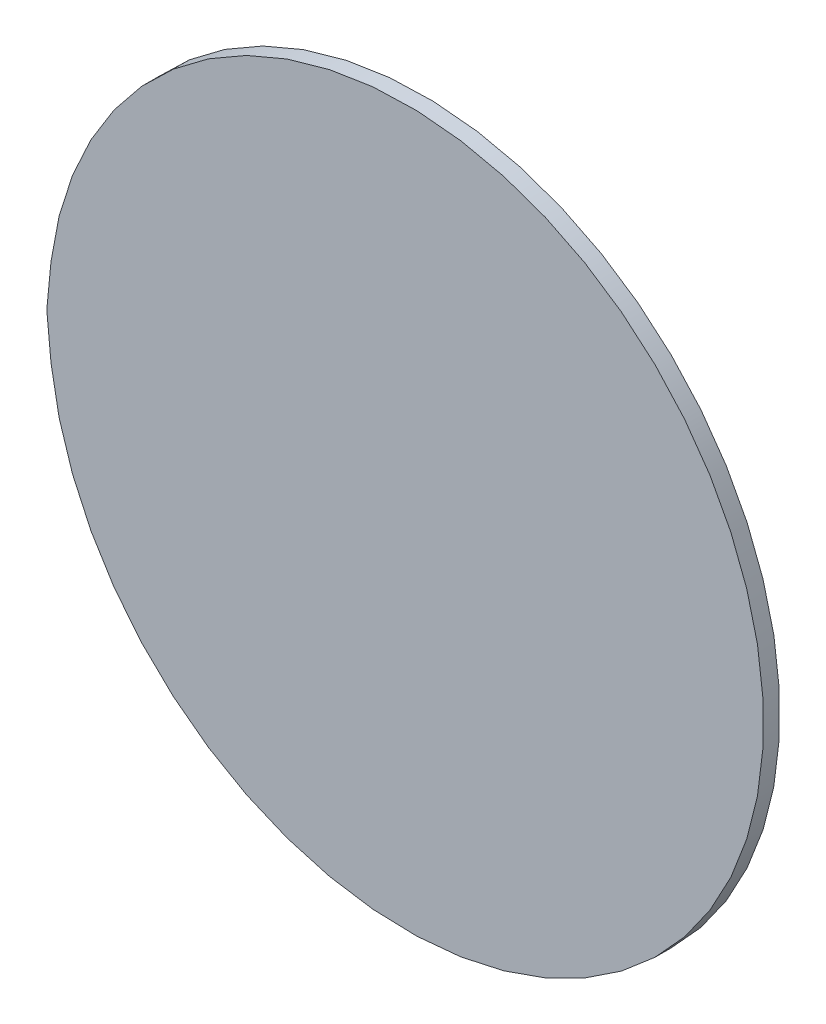
ISO-10303-21;
HEADER;
FILE_DESCRIPTION(('STEP AP214'),'2;1');
FILE_NAME('part.step','',(''),(''),'','','');
FILE_SCHEMA(('AUTOMOTIVE_DESIGN { 1 0 10303 214 1 1 1 1 }'));
ENDSEC;
DATA;
#1=APPLICATION_CONTEXT('core data for automotive mechanical design processes');
#2=APPLICATION_PROTOCOL_DEFINITION('international standard','automotive_design',2000,#1);
#3=PRODUCT_CONTEXT('',#1,'mechanical');
#4=PRODUCT('Part','Part','',(#3));
#5=PRODUCT_RELATED_PRODUCT_CATEGORY('part','',(#4));
#6=PRODUCT_DEFINITION_FORMATION('','',#4);
#7=PRODUCT_DEFINITION_CONTEXT('part definition',#1,'design');
#8=PRODUCT_DEFINITION('design','',#6,#7);
#9=PRODUCT_DEFINITION_SHAPE('','',#8);
#10=(LENGTH_UNIT() NAMED_UNIT(*) SI_UNIT(.MILLI.,.METRE.));
#11=(NAMED_UNIT(*) PLANE_ANGLE_UNIT() SI_UNIT($,.RADIAN.));
#12=(NAMED_UNIT(*) SI_UNIT($,.STERADIAN.) SOLID_ANGLE_UNIT());
#13=UNCERTAINTY_MEASURE_WITH_UNIT(LENGTH_MEASURE(1.E-05),#10,'distance_accuracy_value','');
#14=(GEOMETRIC_REPRESENTATION_CONTEXT(3) GLOBAL_UNCERTAINTY_ASSIGNED_CONTEXT((#13)) GLOBAL_UNIT_ASSIGNED_CONTEXT((#10,
#11,#12)) REPRESENTATION_CONTEXT('',''));
#15=CARTESIAN_POINT('',(0.,0.,0.));
#16=DIRECTION('',(0.,0.,1.));
#17=DIRECTION('',(1.,0.,0.));
#18=AXIS2_PLACEMENT_3D('',#15,#16,#17);
#19=CARTESIAN_POINT('',(-0.449,0.95,1.448));
#20=DIRECTION('',(0.,0.,1.));
#21=DIRECTION('',(1.,0.,0.));
#22=AXIS2_PLACEMENT_3D('',#19,#20,#21);
#23=CYLINDRICAL_SURFACE('',#22,0.043815);
#24=CARTESIAN_POINT('',(-0.449,0.95,1.45));
#25=DIRECTION('',(0.,0.,1.));
#26=DIRECTION('',(1.,0.,0.));
#27=AXIS2_PLACEMENT_3D('',#24,#25,#26);
#28=CIRCLE('',#27,0.043815);
#29=CARTESIAN_POINT('',(-0.493,0.95,1.45));
#30=VERTEX_POINT('',#29);
#31=EDGE_CURVE('E11',#30,#30,#28,.T.);
#32=ORIENTED_EDGE('',*,*,#31,.F.);
#33=CARTESIAN_POINT('',(-0.492815,0.95,1.448));
#34=CARTESIAN_POINT('',(-0.492815,0.95,1.45));
#35=B_SPLINE_CURVE_WITH_KNOTS('',1,(#33,#34),.UNSPECIFIED.,.F.,.F.,(2,2),(0.,0.002),.UNSPECIFIED.);
#36=CARTESIAN_POINT('',(-0.493,0.95,1.448));
#37=VERTEX_POINT('',#36);
#38=EDGE_CURVE('E24',#37,#30,#35,.T.);
#39=ORIENTED_EDGE('',*,*,#38,.F.);
#40=CARTESIAN_POINT('',(-0.449,0.95,1.448));
#41=DIRECTION('',(0.,0.,-1.));
#42=DIRECTION('',(1.,0.,0.));
#43=AXIS2_PLACEMENT_3D('',#40,#41,#42);
#44=CIRCLE('',#43,0.043815);
#45=EDGE_CURVE('E33',#37,#37,#44,.T.);
#46=ORIENTED_EDGE('',*,*,#45,.F.);
#47=ORIENTED_EDGE('',*,*,#38,.T.);
#48=EDGE_LOOP('',(#32,#39,#46,#47));
#49=FACE_BOUND('',#48,.T.);
#50=ADVANCED_FACE('F17',(#49),#23,.T.);
#51=CARTESIAN_POINT('',(-0.449,0.95,1.448));
#52=DIRECTION('',(0.,0.,1.));
#53=DIRECTION('',(0.,1.,0.));
#54=AXIS2_PLACEMENT_3D('',#51,#52,#53);
#55=PLANE('',#54);
#56=ORIENTED_EDGE('',*,*,#45,.T.);
#57=EDGE_LOOP('',(#56));
#58=FACE_BOUND('',#57,.T.);
#59=ADVANCED_FACE('F36',(#58),#55,.F.);
#60=CARTESIAN_POINT('',(-0.449,0.95,1.45));
#61=DIRECTION('',(0.,0.,1.));
#62=DIRECTION('',(0.,1.,0.));
#63=AXIS2_PLACEMENT_3D('',#60,#61,#62);
#64=PLANE('',#63);
#65=ORIENTED_EDGE('',*,*,#31,.T.);
#66=EDGE_LOOP('',(#65));
#67=FACE_BOUND('',#66,.T.);
#68=ADVANCED_FACE('F49',(#67),#64,.T.);
#69=CLOSED_SHELL('',(#50,#59,#68));
#70=MANIFOLD_SOLID_BREP('B1',#69);
#71=ADVANCED_BREP_SHAPE_REPRESENTATION('',(#18,#70),#14);
#72=SHAPE_DEFINITION_REPRESENTATION(#9,#71);
ENDSEC;
END-ISO-10303-21;
